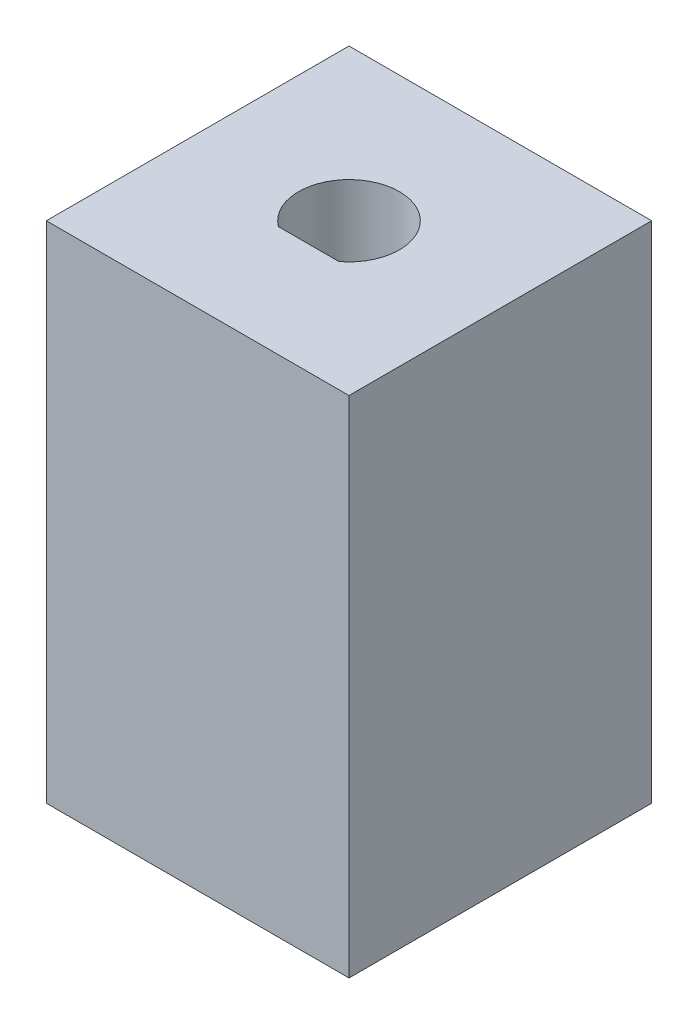
ISO-10303-21;
HEADER;
FILE_DESCRIPTION(('STEP AP214'),'2;1');
FILE_NAME('part.step','',(''),(''),'','','');
FILE_SCHEMA(('AUTOMOTIVE_DESIGN { 1 0 10303 214 1 1 1 1 }'));
ENDSEC;
DATA;
#1=APPLICATION_CONTEXT('core data for automotive mechanical design processes');
#2=APPLICATION_PROTOCOL_DEFINITION('international standard','automotive_design',2000,#1);
#3=PRODUCT_CONTEXT('',#1,'mechanical');
#4=PRODUCT('Part','Part','',(#3));
#5=PRODUCT_RELATED_PRODUCT_CATEGORY('part','',(#4));
#6=PRODUCT_DEFINITION_FORMATION('','',#4);
#7=PRODUCT_DEFINITION_CONTEXT('part definition',#1,'design');
#8=PRODUCT_DEFINITION('design','',#6,#7);
#9=PRODUCT_DEFINITION_SHAPE('','',#8);
#10=(LENGTH_UNIT() NAMED_UNIT(*) SI_UNIT(.MILLI.,.METRE.));
#11=(NAMED_UNIT(*) PLANE_ANGLE_UNIT() SI_UNIT($,.RADIAN.));
#12=(NAMED_UNIT(*) SI_UNIT($,.STERADIAN.) SOLID_ANGLE_UNIT());
#13=UNCERTAINTY_MEASURE_WITH_UNIT(LENGTH_MEASURE(1.E-05),#10,'distance_accuracy_value','');
#14=(GEOMETRIC_REPRESENTATION_CONTEXT(3) GLOBAL_UNCERTAINTY_ASSIGNED_CONTEXT((#13)) GLOBAL_UNIT_ASSIGNED_CONTEXT((#10,
#11,#12)) REPRESENTATION_CONTEXT('',''));
#15=CARTESIAN_POINT('',(0.,0.,0.));
#16=DIRECTION('',(0.,0.,1.));
#17=DIRECTION('',(1.,0.,0.));
#18=AXIS2_PLACEMENT_3D('',#15,#16,#17);
#19=CARTESIAN_POINT('',(0.,25.,0.));
#20=DIRECTION('',(1.,0.,0.));
#21=DIRECTION('',(0.,0.,-1.));
#22=AXIS2_PLACEMENT_3D('',#19,#20,#21);
#23=PLANE('',#22);
#24=DIRECTION('',(0.,0.,1.));
#25=VECTOR('',#24,1.);
#26=CARTESIAN_POINT('',(0.,0.,0.));
#27=LINE('',#26,#25);
#28=CARTESIAN_POINT('',(0.,0.,-15.));
#29=VERTEX_POINT('',#28);
#30=CARTESIAN_POINT('',(0.,0.,0.));
#31=VERTEX_POINT('',#30);
#32=EDGE_CURVE('E113',#29,#31,#27,.T.);
#33=ORIENTED_EDGE('',*,*,#32,.T.);
#34=DIRECTION('',(0.,-1.,0.));
#35=VECTOR('',#34,1.);
#36=CARTESIAN_POINT('',(0.,25.,0.));
#37=LINE('',#36,#35);
#38=CARTESIAN_POINT('',(0.,25.,0.));
#39=VERTEX_POINT('',#38);
#40=EDGE_CURVE('E11',#39,#31,#37,.T.);
#41=ORIENTED_EDGE('',*,*,#40,.F.);
#42=DIRECTION('',(0.,0.,1.));
#43=VECTOR('',#42,1.);
#44=CARTESIAN_POINT('',(0.,25.,0.));
#45=LINE('',#44,#43);
#46=CARTESIAN_POINT('',(0.,25.,-15.));
#47=VERTEX_POINT('',#46);
#48=EDGE_CURVE('E115',#47,#39,#45,.T.);
#49=ORIENTED_EDGE('',*,*,#48,.F.);
#50=DIRECTION('',(0.,-1.,0.));
#51=VECTOR('',#50,1.);
#52=CARTESIAN_POINT('',(0.,25.,-15.));
#53=LINE('',#52,#51);
#54=EDGE_CURVE('E121',#47,#29,#53,.T.);
#55=ORIENTED_EDGE('',*,*,#54,.T.);
#56=EDGE_LOOP('',(#33,#41,#49,#55));
#57=FACE_BOUND('',#56,.T.);
#58=ADVANCED_FACE('F33',(#57),#23,.F.);
#59=CARTESIAN_POINT('',(0.,25.,0.));
#60=DIRECTION('',(0.,0.,-1.));
#61=DIRECTION('',(-1.,0.,0.));
#62=AXIS2_PLACEMENT_3D('',#59,#60,#61);
#63=PLANE('',#62);
#64=DIRECTION('',(1.,0.,0.));
#65=VECTOR('',#64,1.);
#66=CARTESIAN_POINT('',(0.,0.,0.));
#67=LINE('',#66,#65);
#68=CARTESIAN_POINT('',(15.,0.,0.));
#69=VERTEX_POINT('',#68);
#70=EDGE_CURVE('E124',#31,#69,#67,.T.);
#71=ORIENTED_EDGE('',*,*,#70,.T.);
#72=DIRECTION('',(0.,-1.,0.));
#73=VECTOR('',#72,1.);
#74=CARTESIAN_POINT('',(15.,25.,0.));
#75=LINE('',#74,#73);
#76=CARTESIAN_POINT('',(15.,25.,0.));
#77=VERTEX_POINT('',#76);
#78=EDGE_CURVE('E40',#77,#69,#75,.T.);
#79=ORIENTED_EDGE('',*,*,#78,.F.);
#80=DIRECTION('',(1.,0.,0.));
#81=VECTOR('',#80,1.);
#82=CARTESIAN_POINT('',(0.,25.,0.));
#83=LINE('',#82,#81);
#84=EDGE_CURVE('E84',#39,#77,#83,.T.);
#85=ORIENTED_EDGE('',*,*,#84,.F.);
#86=ORIENTED_EDGE('',*,*,#40,.T.);
#87=EDGE_LOOP('',(#71,#79,#85,#86));
#88=FACE_BOUND('',#87,.T.);
#89=ADVANCED_FACE('F153',(#88),#63,.F.);
#90=CARTESIAN_POINT('',(15.,25.,0.));
#91=DIRECTION('',(-1.,0.,0.));
#92=DIRECTION('',(0.,0.,1.));
#93=AXIS2_PLACEMENT_3D('',#90,#91,#92);
#94=PLANE('',#93);
#95=DIRECTION('',(0.,0.,-1.));
#96=VECTOR('',#95,1.);
#97=CARTESIAN_POINT('',(15.,0.,0.));
#98=LINE('',#97,#96);
#99=CARTESIAN_POINT('',(15.,0.,-15.));
#100=VERTEX_POINT('',#99);
#101=EDGE_CURVE('E126',#69,#100,#98,.T.);
#102=ORIENTED_EDGE('',*,*,#101,.T.);
#103=DIRECTION('',(0.,-1.,0.));
#104=VECTOR('',#103,1.);
#105=CARTESIAN_POINT('',(15.,25.,-15.));
#106=LINE('',#105,#104);
#107=CARTESIAN_POINT('',(15.,25.,-15.));
#108=VERTEX_POINT('',#107);
#109=EDGE_CURVE('E130',#108,#100,#106,.T.);
#110=ORIENTED_EDGE('',*,*,#109,.F.);
#111=DIRECTION('',(0.,0.,-1.));
#112=VECTOR('',#111,1.);
#113=CARTESIAN_POINT('',(15.,25.,0.));
#114=LINE('',#113,#112);
#115=EDGE_CURVE('E118',#77,#108,#114,.T.);
#116=ORIENTED_EDGE('',*,*,#115,.F.);
#117=ORIENTED_EDGE('',*,*,#78,.T.);
#118=EDGE_LOOP('',(#102,#110,#116,#117));
#119=FACE_BOUND('',#118,.T.);
#120=ADVANCED_FACE('F135',(#119),#94,.F.);
#121=CARTESIAN_POINT('',(0.,25.,-15.));
#122=DIRECTION('',(0.,0.,1.));
#123=DIRECTION('',(1.,0.,0.));
#124=AXIS2_PLACEMENT_3D('',#121,#122,#123);
#125=PLANE('',#124);
#126=DIRECTION('',(-1.,0.,0.));
#127=VECTOR('',#126,1.);
#128=CARTESIAN_POINT('',(0.,0.,-15.));
#129=LINE('',#128,#127);
#130=EDGE_CURVE('E77',#100,#29,#129,.T.);
#131=ORIENTED_EDGE('',*,*,#130,.T.);
#132=ORIENTED_EDGE('',*,*,#54,.F.);
#133=DIRECTION('',(-1.,0.,0.));
#134=VECTOR('',#133,1.);
#135=CARTESIAN_POINT('',(0.,25.,-15.));
#136=LINE('',#135,#134);
#137=EDGE_CURVE('E56',#108,#47,#136,.T.);
#138=ORIENTED_EDGE('',*,*,#137,.F.);
#139=ORIENTED_EDGE('',*,*,#109,.T.);
#140=EDGE_LOOP('',(#131,#132,#138,#139));
#141=FACE_BOUND('',#140,.T.);
#142=ADVANCED_FACE('F143',(#141),#125,.F.);
#143=CARTESIAN_POINT('',(0.,25.,0.));
#144=DIRECTION('',(0.,-1.,0.));
#145=DIRECTION('',(0.,0.,-1.));
#146=AXIS2_PLACEMENT_3D('',#143,#144,#145);
#147=PLANE('',#146);
#148=DIRECTION('',(1.,0.,0.));
#149=VECTOR('',#148,1.);
#150=CARTESIAN_POINT('',(6.,25.,-5.5));
#151=LINE('',#150,#149);
#152=CARTESIAN_POINT('',(6.,25.,-5.5));
#153=VERTEX_POINT('',#152);
#154=CARTESIAN_POINT('',(9.,25.,-5.5));
#155=VERTEX_POINT('',#154);
#156=EDGE_CURVE('E106',#153,#155,#151,.T.);
#157=ORIENTED_EDGE('',*,*,#156,.F.);
#158=CARTESIAN_POINT('',(7.5,25.,-7.5));
#159=DIRECTION('',(0.,1.,0.));
#160=DIRECTION('',(0.,0.,1.));
#161=AXIS2_PLACEMENT_3D('',#158,#159,#160);
#162=CIRCLE('',#161,2.5);
#163=EDGE_CURVE('E47',#155,#153,#162,.T.);
#164=ORIENTED_EDGE('',*,*,#163,.F.);
#165=EDGE_LOOP('',(#157,#164));
#166=FACE_BOUND('',#165,.T.);
#167=ORIENTED_EDGE('',*,*,#48,.T.);
#168=ORIENTED_EDGE('',*,*,#84,.T.);
#169=ORIENTED_EDGE('',*,*,#115,.T.);
#170=ORIENTED_EDGE('',*,*,#137,.T.);
#171=EDGE_LOOP('',(#167,#168,#169,#170));
#172=FACE_BOUND('',#171,.T.);
#173=ADVANCED_FACE('F145',(#166,#172),#147,.F.);
#174=CARTESIAN_POINT('',(0.,0.,0.));
#175=DIRECTION('',(0.,-1.,0.));
#176=DIRECTION('',(0.,0.,-1.));
#177=AXIS2_PLACEMENT_3D('',#174,#175,#176);
#178=PLANE('',#177);
#179=ORIENTED_EDGE('',*,*,#32,.F.);
#180=ORIENTED_EDGE('',*,*,#130,.F.);
#181=ORIENTED_EDGE('',*,*,#101,.F.);
#182=ORIENTED_EDGE('',*,*,#70,.F.);
#183=EDGE_LOOP('',(#179,#180,#181,#182));
#184=FACE_BOUND('',#183,.T.);
#185=ADVANCED_FACE('F139',(#184),#178,.T.);
#186=CARTESIAN_POINT('',(7.5,5.,-7.5));
#187=DIRECTION('',(0.,1.,0.));
#188=DIRECTION('',(0.,0.,1.));
#189=AXIS2_PLACEMENT_3D('',#186,#187,#188);
#190=CYLINDRICAL_SURFACE('',#189,2.5);
#191=ORIENTED_EDGE('',*,*,#163,.T.);
#192=DIRECTION('',(0.,1.,0.));
#193=VECTOR('',#192,1.);
#194=CARTESIAN_POINT('',(6.,5.,-5.5));
#195=LINE('',#194,#193);
#196=CARTESIAN_POINT('',(6.,5.,-5.5));
#197=VERTEX_POINT('',#196);
#198=EDGE_CURVE('E92',#197,#153,#195,.T.);
#199=ORIENTED_EDGE('',*,*,#198,.F.);
#200=CARTESIAN_POINT('',(7.5,5.,-7.5));
#201=DIRECTION('',(0.,1.,0.));
#202=DIRECTION('',(0.,0.,1.));
#203=AXIS2_PLACEMENT_3D('',#200,#201,#202);
#204=CIRCLE('',#203,2.5);
#205=CARTESIAN_POINT('',(9.,5.,-5.5));
#206=VERTEX_POINT('',#205);
#207=EDGE_CURVE('E95',#206,#197,#204,.T.);
#208=ORIENTED_EDGE('',*,*,#207,.F.);
#209=DIRECTION('',(0.,1.,0.));
#210=VECTOR('',#209,1.);
#211=CARTESIAN_POINT('',(9.,5.,-5.5));
#212=LINE('',#211,#210);
#213=EDGE_CURVE('E101',#206,#155,#212,.T.);
#214=ORIENTED_EDGE('',*,*,#213,.T.);
#215=EDGE_LOOP('',(#191,#199,#208,#214));
#216=FACE_BOUND('',#215,.T.);
#217=ADVANCED_FACE('F94',(#216),#190,.F.);
#218=CARTESIAN_POINT('',(6.,5.,-5.5));
#219=DIRECTION('',(0.,0.,1.));
#220=DIRECTION('',(1.,0.,0.));
#221=AXIS2_PLACEMENT_3D('',#218,#219,#220);
#222=PLANE('',#221);
#223=ORIENTED_EDGE('',*,*,#156,.T.);
#224=ORIENTED_EDGE('',*,*,#213,.F.);
#225=DIRECTION('',(1.,0.,0.));
#226=VECTOR('',#225,1.);
#227=CARTESIAN_POINT('',(6.,5.,-5.5));
#228=LINE('',#227,#226);
#229=EDGE_CURVE('E102',#197,#206,#228,.T.);
#230=ORIENTED_EDGE('',*,*,#229,.F.);
#231=ORIENTED_EDGE('',*,*,#198,.T.);
#232=EDGE_LOOP('',(#223,#224,#230,#231));
#233=FACE_BOUND('',#232,.T.);
#234=ADVANCED_FACE('F108',(#233),#222,.F.);
#235=CARTESIAN_POINT('',(7.5,5.,-7.5));
#236=DIRECTION('',(0.,1.,0.));
#237=DIRECTION('',(0.,0.,1.));
#238=AXIS2_PLACEMENT_3D('',#235,#236,#237);
#239=PLANE('',#238);
#240=ORIENTED_EDGE('',*,*,#207,.T.);
#241=ORIENTED_EDGE('',*,*,#229,.T.);
#242=EDGE_LOOP('',(#240,#241));
#243=FACE_BOUND('',#242,.T.);
#244=ADVANCED_FACE('F105',(#243),#239,.T.);
#245=CLOSED_SHELL('',(#58,#89,#120,#142,#173,#185,#217,#234,#244));
#246=MANIFOLD_SOLID_BREP('B2',#245);
#247=ADVANCED_BREP_SHAPE_REPRESENTATION('',(#18,#246),#14);
#248=SHAPE_DEFINITION_REPRESENTATION(#9,#247);
ENDSEC;
END-ISO-10303-21;
